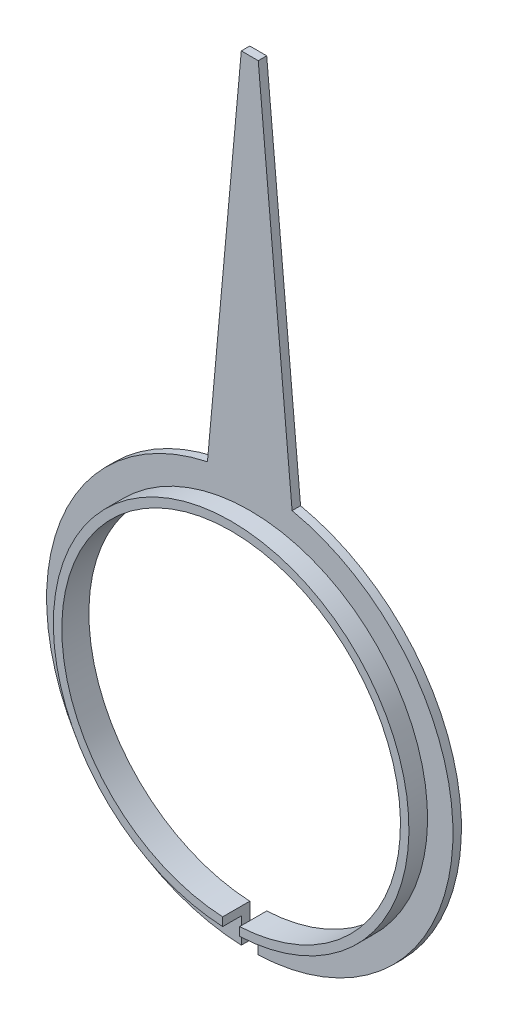
ISO-10303-21;
HEADER;
FILE_DESCRIPTION(('STEP AP214'),'2;1');
FILE_NAME('part.step','',(''),(''),'','','');
FILE_SCHEMA(('AUTOMOTIVE_DESIGN { 1 0 10303 214 1 1 1 1 }'));
ENDSEC;
DATA;
#1=APPLICATION_CONTEXT('core data for automotive mechanical design processes');
#2=APPLICATION_PROTOCOL_DEFINITION('international standard','automotive_design',2000,#1);
#3=PRODUCT_CONTEXT('',#1,'mechanical');
#4=PRODUCT('Part','Part','',(#3));
#5=PRODUCT_RELATED_PRODUCT_CATEGORY('part','',(#4));
#6=PRODUCT_DEFINITION_FORMATION('','',#4);
#7=PRODUCT_DEFINITION_CONTEXT('part definition',#1,'design');
#8=PRODUCT_DEFINITION('design','',#6,#7);
#9=PRODUCT_DEFINITION_SHAPE('','',#8);
#10=(LENGTH_UNIT() NAMED_UNIT(*) SI_UNIT(.MILLI.,.METRE.));
#11=(NAMED_UNIT(*) PLANE_ANGLE_UNIT() SI_UNIT($,.RADIAN.));
#12=(NAMED_UNIT(*) SI_UNIT($,.STERADIAN.) SOLID_ANGLE_UNIT());
#13=UNCERTAINTY_MEASURE_WITH_UNIT(LENGTH_MEASURE(1.E-05),#10,'distance_accuracy_value','');
#14=(GEOMETRIC_REPRESENTATION_CONTEXT(3) GLOBAL_UNCERTAINTY_ASSIGNED_CONTEXT((#13)) GLOBAL_UNIT_ASSIGNED_CONTEXT((#10,
#11,#12)) REPRESENTATION_CONTEXT('',''));
#15=CARTESIAN_POINT('',(0.,0.,0.));
#16=DIRECTION('',(0.,0.,1.));
#17=DIRECTION('',(1.,0.,0.));
#18=AXIS2_PLACEMENT_3D('',#15,#16,#17);
#19=CARTESIAN_POINT('',(0.,0.,0.));
#20=DIRECTION('',(0.,0.,1.));
#21=DIRECTION('',(1.,0.,0.));
#22=AXIS2_PLACEMENT_3D('',#19,#20,#21);
#23=PLANE('',#22);
#24=DIRECTION('',(0.,1.,0.));
#25=VECTOR('',#24,1.);
#26=CARTESIAN_POINT('',(0.1,-1.81103581923026,0.));
#27=LINE('',#26,#25);
#28=CARTESIAN_POINT('',(0.1,-2.39791576165636,0.));
#29=VERTEX_POINT('',#28);
#30=CARTESIAN_POINT('',(0.1,-1.99749843554382,0.));
#31=VERTEX_POINT('',#30);
#32=EDGE_CURVE('E106',#29,#31,#27,.T.);
#33=ORIENTED_EDGE('',*,*,#32,.T.);
#34=CARTESIAN_POINT('',(0.,0.,0.));
#35=DIRECTION('',(0.,0.,1.));
#36=DIRECTION('',(1.,0.,0.));
#37=AXIS2_PLACEMENT_3D('',#34,#35,#36);
#38=CIRCLE('',#37,2.);
#39=CARTESIAN_POINT('',(-0.099999999999986,-1.99749843554382,0.));
#40=VERTEX_POINT('',#39);
#41=EDGE_CURVE('E123',#31,#40,#38,.T.);
#42=ORIENTED_EDGE('',*,*,#41,.T.);
#43=DIRECTION('',(0.,-1.,0.));
#44=VECTOR('',#43,1.);
#45=CARTESIAN_POINT('',(-0.0999999999999873,-1.81103581923026,0.));
#46=LINE('',#45,#44);
#47=CARTESIAN_POINT('',(-0.0999999999999833,-2.39791576165636,0.));
#48=VERTEX_POINT('',#47);
#49=EDGE_CURVE('E47',#40,#48,#46,.T.);
#50=ORIENTED_EDGE('',*,*,#49,.T.);
#51=CARTESIAN_POINT('',(0.,0.,0.));
#52=DIRECTION('',(0.,0.,1.));
#53=DIRECTION('',(1.,0.,0.));
#54=AXIS2_PLACEMENT_3D('',#51,#52,#53);
#55=CIRCLE('',#54,2.4);
#56=CARTESIAN_POINT('',(-0.500000000000016,2.3473389188611,0.));
#57=VERTEX_POINT('',#56);
#58=EDGE_CURVE('E129',#57,#48,#55,.T.);
#59=ORIENTED_EDGE('',*,*,#58,.F.);
#60=DIRECTION('',(-0.0904814720566437,-0.995898138975298,0.));
#61=VECTOR('',#60,1.);
#62=CARTESIAN_POINT('',(-0.100000000001707,6.75000000000546,0.));
#63=LINE('',#62,#61);
#64=CARTESIAN_POINT('',(-0.100000000001707,6.75000000000546,0.));
#65=VERTEX_POINT('',#64);
#66=EDGE_CURVE('E130',#65,#57,#63,.T.);
#67=ORIENTED_EDGE('',*,*,#66,.F.);
#68=DIRECTION('',(-1.,2.72872002766558E-11,0.));
#69=VECTOR('',#68,1.);
#70=CARTESIAN_POINT('',(0.,6.75000000000819,0.));
#71=LINE('',#70,#69);
#72=CARTESIAN_POINT('',(0.10000000000166,6.75000000000546,0.));
#73=VERTEX_POINT('',#72);
#74=EDGE_CURVE('E138',#73,#65,#71,.T.);
#75=ORIENTED_EDGE('',*,*,#74,.F.);
#76=DIRECTION('',(-0.0904814720566506,0.995898138975298,0.));
#77=VECTOR('',#76,1.);
#78=CARTESIAN_POINT('',(0.10000000000166,6.75000000000546,0.));
#79=LINE('',#78,#77);
#80=CARTESIAN_POINT('',(0.5,2.3473389188611,0.));
#81=VERTEX_POINT('',#80);
#82=EDGE_CURVE('E128',#81,#73,#79,.T.);
#83=ORIENTED_EDGE('',*,*,#82,.F.);
#84=EDGE_CURVE('E120',#29,#81,#55,.T.);
#85=ORIENTED_EDGE('',*,*,#84,.F.);
#86=EDGE_LOOP('',(#33,#42,#50,#59,#67,#75,#83,#85));
#87=FACE_BOUND('',#86,.T.);
#88=ADVANCED_FACE('F32',(#87),#23,.F.);
#89=CARTESIAN_POINT('',(0.,0.,0.32));
#90=DIRECTION('',(0.,0.,1.));
#91=DIRECTION('',(1.,0.,0.));
#92=AXIS2_PLACEMENT_3D('',#89,#90,#91);
#93=PLANE('',#92);
#94=CARTESIAN_POINT('',(0.,0.,0.32));
#95=DIRECTION('',(0.,0.,1.));
#96=DIRECTION('',(1.,0.,0.));
#97=AXIS2_PLACEMENT_3D('',#94,#95,#96);
#98=CIRCLE('',#97,2.);
#99=CARTESIAN_POINT('',(0.1,-1.99749843554382,0.32));
#100=VERTEX_POINT('',#99);
#101=CARTESIAN_POINT('',(-0.099999999999986,-1.99749843554382,0.32));
#102=VERTEX_POINT('',#101);
#103=EDGE_CURVE('E156',#100,#102,#98,.T.);
#104=ORIENTED_EDGE('',*,*,#103,.F.);
#105=DIRECTION('',(0.,1.,0.));
#106=VECTOR('',#105,1.);
#107=CARTESIAN_POINT('',(0.1,-1.81103581923026,0.32));
#108=LINE('',#107,#106);
#109=CARTESIAN_POINT('',(0.1,-2.0976176963403,0.32));
#110=VERTEX_POINT('',#109);
#111=EDGE_CURVE('E55',#110,#100,#108,.T.);
#112=ORIENTED_EDGE('',*,*,#111,.F.);
#113=CARTESIAN_POINT('',(0.,0.,0.32));
#114=DIRECTION('',(0.,0.,1.));
#115=DIRECTION('',(1.,0.,0.));
#116=AXIS2_PLACEMENT_3D('',#113,#114,#115);
#117=CIRCLE('',#116,2.1);
#118=CARTESIAN_POINT('',(-0.0999999999999854,-2.0976176963403,0.32));
#119=VERTEX_POINT('',#118);
#120=EDGE_CURVE('E160',#110,#119,#117,.T.);
#121=ORIENTED_EDGE('',*,*,#120,.T.);
#122=DIRECTION('',(0.,-1.,0.));
#123=VECTOR('',#122,1.);
#124=CARTESIAN_POINT('',(-0.0999999999999873,-1.81103581923026,0.32));
#125=LINE('',#124,#123);
#126=EDGE_CURVE('E208',#102,#119,#125,.T.);
#127=ORIENTED_EDGE('',*,*,#126,.F.);
#128=EDGE_LOOP('',(#104,#112,#121,#127));
#129=FACE_BOUND('',#128,.T.);
#130=ADVANCED_FACE('F207',(#129),#93,.T.);
#131=CARTESIAN_POINT('',(0.,0.,0.1));
#132=DIRECTION('',(0.,0.,1.));
#133=DIRECTION('',(1.,0.,0.));
#134=AXIS2_PLACEMENT_3D('',#131,#132,#133);
#135=PLANE('',#134);
#136=CARTESIAN_POINT('',(0.,0.,0.1));
#137=DIRECTION('',(0.,0.,1.));
#138=DIRECTION('',(1.,0.,0.));
#139=AXIS2_PLACEMENT_3D('',#136,#137,#138);
#140=CIRCLE('',#139,2.1);
#141=CARTESIAN_POINT('',(-0.0999999999999853,-2.0976176963403,0.1));
#142=VERTEX_POINT('',#141);
#143=CARTESIAN_POINT('',(0.1,-2.0976176963403,0.1));
#144=VERTEX_POINT('',#143);
#145=EDGE_CURVE('E133',#142,#144,#140,.F.);
#146=ORIENTED_EDGE('',*,*,#145,.T.);
#147=DIRECTION('',(0.,-1.,0.));
#148=VECTOR('',#147,1.);
#149=CARTESIAN_POINT('',(0.1,0.,0.1));
#150=LINE('',#149,#148);
#151=CARTESIAN_POINT('',(0.1,-2.39791576165636,0.1));
#152=VERTEX_POINT('',#151);
#153=EDGE_CURVE('E124',#144,#152,#150,.T.);
#154=ORIENTED_EDGE('',*,*,#153,.T.);
#155=CARTESIAN_POINT('',(0.,0.,0.1));
#156=DIRECTION('',(0.,0.,1.));
#157=DIRECTION('',(1.,0.,0.));
#158=AXIS2_PLACEMENT_3D('',#155,#156,#157);
#159=CIRCLE('',#158,2.4);
#160=CARTESIAN_POINT('',(0.5,2.3473389188611,0.1));
#161=VERTEX_POINT('',#160);
#162=EDGE_CURVE('E122',#152,#161,#159,.T.);
#163=ORIENTED_EDGE('',*,*,#162,.T.);
#164=DIRECTION('',(-0.0904814720566506,0.995898138975298,0.));
#165=VECTOR('',#164,1.);
#166=CARTESIAN_POINT('',(0.10000000000166,6.75000000000546,0.1));
#167=LINE('',#166,#165);
#168=CARTESIAN_POINT('',(0.10000000000166,6.75000000000546,0.1));
#169=VERTEX_POINT('',#168);
#170=EDGE_CURVE('E145',#161,#169,#167,.T.);
#171=ORIENTED_EDGE('',*,*,#170,.T.);
#172=DIRECTION('',(-1.,-2.72872002766558E-11,0.));
#173=VECTOR('',#172,1.);
#174=CARTESIAN_POINT('',(0.,6.75000000000819,0.1));
#175=LINE('',#174,#173);
#176=CARTESIAN_POINT('',(-0.100000000001707,6.75000000000546,0.1));
#177=VERTEX_POINT('',#176);
#178=EDGE_CURVE('E140',#169,#177,#175,.T.);
#179=ORIENTED_EDGE('',*,*,#178,.T.);
#180=DIRECTION('',(-0.0904814720566437,-0.995898138975298,0.));
#181=VECTOR('',#180,1.);
#182=CARTESIAN_POINT('',(-0.100000000001707,6.75000000000546,0.1));
#183=LINE('',#182,#181);
#184=CARTESIAN_POINT('',(-0.500000000000016,2.3473389188611,0.1));
#185=VERTEX_POINT('',#184);
#186=EDGE_CURVE('E169',#177,#185,#183,.T.);
#187=ORIENTED_EDGE('',*,*,#186,.T.);
#188=CARTESIAN_POINT('',(-0.0999999999999833,-2.39791576165636,0.1));
#189=VERTEX_POINT('',#188);
#190=EDGE_CURVE('E171',#185,#189,#159,.T.);
#191=ORIENTED_EDGE('',*,*,#190,.T.);
#192=DIRECTION('',(0.,1.,0.));
#193=VECTOR('',#192,1.);
#194=CARTESIAN_POINT('',(-0.1,0.,0.1));
#195=LINE('',#194,#193);
#196=EDGE_CURVE('E188',#189,#142,#195,.T.);
#197=ORIENTED_EDGE('',*,*,#196,.T.);
#198=EDGE_LOOP('',(#146,#154,#163,#171,#179,#187,#191,#197));
#199=FACE_BOUND('',#198,.T.);
#200=ADVANCED_FACE('F177',(#199),#135,.T.);
#201=CARTESIAN_POINT('',(0.,0.,0.1));
#202=DIRECTION('',(0.,0.,-1.));
#203=DIRECTION('',(-1.,0.,0.));
#204=AXIS2_PLACEMENT_3D('',#201,#202,#203);
#205=CYLINDRICAL_SURFACE('',#204,2.4);
#206=DIRECTION('',(0.,0.,-1.));
#207=VECTOR('',#206,1.);
#208=CARTESIAN_POINT('',(0.1,-2.39791576165636,0.1));
#209=LINE('',#208,#207);
#210=EDGE_CURVE('E109',#29,#152,#209,.F.);
#211=ORIENTED_EDGE('',*,*,#210,.F.);
#212=ORIENTED_EDGE('',*,*,#84,.T.);
#213=DIRECTION('',(0.,0.,-1.));
#214=VECTOR('',#213,1.);
#215=CARTESIAN_POINT('',(0.5,2.3473389188611,0.1));
#216=LINE('',#215,#214);
#217=EDGE_CURVE('E144',#161,#81,#216,.T.);
#218=ORIENTED_EDGE('',*,*,#217,.F.);
#219=ORIENTED_EDGE('',*,*,#162,.F.);
#220=EDGE_LOOP('',(#211,#212,#218,#219));
#221=FACE_BOUND('',#220,.T.);
#222=ADVANCED_FACE('F118',(#221),#205,.T.);
#223=DIRECTION('',(0.,0.,-1.));
#224=VECTOR('',#223,1.);
#225=CARTESIAN_POINT('',(-0.0999999999999832,-2.39791576165636,0.1));
#226=LINE('',#225,#224);
#227=EDGE_CURVE('E193',#189,#48,#226,.T.);
#228=ORIENTED_EDGE('',*,*,#227,.F.);
#229=ORIENTED_EDGE('',*,*,#190,.F.);
#230=DIRECTION('',(0.,0.,-1.));
#231=VECTOR('',#230,1.);
#232=CARTESIAN_POINT('',(-0.500000000000016,2.3473389188611,0.1));
#233=LINE('',#232,#231);
#234=EDGE_CURVE('E147',#185,#57,#233,.T.);
#235=ORIENTED_EDGE('',*,*,#234,.T.);
#236=ORIENTED_EDGE('',*,*,#58,.T.);
#237=EDGE_LOOP('',(#228,#229,#235,#236));
#238=FACE_BOUND('',#237,.T.);
#239=ADVANCED_FACE('F192',(#238),#205,.T.);
#240=CARTESIAN_POINT('',(0.,0.,0.32));
#241=DIRECTION('',(0.,0.,-1.));
#242=DIRECTION('',(-1.,0.,0.));
#243=AXIS2_PLACEMENT_3D('',#240,#241,#242);
#244=CYLINDRICAL_SURFACE('',#243,2.1);
#245=DIRECTION('',(0.,0.,-1.));
#246=VECTOR('',#245,1.);
#247=CARTESIAN_POINT('',(0.1,-2.0976176963403,0.32));
#248=LINE('',#247,#246);
#249=EDGE_CURVE('E194',#144,#110,#248,.F.);
#250=ORIENTED_EDGE('',*,*,#249,.F.);
#251=ORIENTED_EDGE('',*,*,#145,.F.);
#252=DIRECTION('',(0.,0.,-1.));
#253=VECTOR('',#252,1.);
#254=CARTESIAN_POINT('',(-0.0999999999999853,-2.0976176963403,0.32));
#255=LINE('',#254,#253);
#256=EDGE_CURVE('E197',#119,#142,#255,.T.);
#257=ORIENTED_EDGE('',*,*,#256,.F.);
#258=ORIENTED_EDGE('',*,*,#120,.F.);
#259=EDGE_LOOP('',(#250,#251,#257,#258));
#260=FACE_BOUND('',#259,.T.);
#261=ADVANCED_FACE('F204',(#260),#244,.T.);
#262=CARTESIAN_POINT('',(0.,0.,0.32));
#263=DIRECTION('',(0.,0.,-1.));
#264=DIRECTION('',(-1.,0.,0.));
#265=AXIS2_PLACEMENT_3D('',#262,#263,#264);
#266=CYLINDRICAL_SURFACE('',#265,2.);
#267=ORIENTED_EDGE('',*,*,#41,.F.);
#268=DIRECTION('',(0.,0.,-1.));
#269=VECTOR('',#268,1.);
#270=CARTESIAN_POINT('',(0.1,-1.99749843554382,0.32));
#271=LINE('',#270,#269);
#272=EDGE_CURVE('E11',#31,#100,#271,.F.);
#273=ORIENTED_EDGE('',*,*,#272,.T.);
#274=ORIENTED_EDGE('',*,*,#103,.T.);
#275=DIRECTION('',(0.,0.,-1.));
#276=VECTOR('',#275,1.);
#277=CARTESIAN_POINT('',(-0.099999999999986,-1.99749843554382,0.32));
#278=LINE('',#277,#276);
#279=EDGE_CURVE('E40',#102,#40,#278,.T.);
#280=ORIENTED_EDGE('',*,*,#279,.T.);
#281=EDGE_LOOP('',(#267,#273,#274,#280));
#282=FACE_BOUND('',#281,.T.);
#283=ADVANCED_FACE('F154',(#282),#266,.F.);
#284=CARTESIAN_POINT('',(-0.100000000001707,6.75000000000546,0.1));
#285=DIRECTION('',(0.995898138975298,-0.0904814720566437,0.));
#286=DIRECTION('',(0.0904814720566437,0.995898138975298,0.));
#287=AXIS2_PLACEMENT_3D('',#284,#285,#286);
#288=PLANE('',#287);
#289=ORIENTED_EDGE('',*,*,#66,.T.);
#290=ORIENTED_EDGE('',*,*,#234,.F.);
#291=ORIENTED_EDGE('',*,*,#186,.F.);
#292=DIRECTION('',(0.,0.,-1.));
#293=VECTOR('',#292,1.);
#294=CARTESIAN_POINT('',(-0.100000000001707,6.75000000000546,0.1));
#295=LINE('',#294,#293);
#296=EDGE_CURVE('E150',#177,#65,#295,.T.);
#297=ORIENTED_EDGE('',*,*,#296,.T.);
#298=EDGE_LOOP('',(#289,#290,#291,#297));
#299=FACE_BOUND('',#298,.T.);
#300=ADVANCED_FACE('F34',(#299),#288,.F.);
#301=CARTESIAN_POINT('',(0.10000000000166,6.75000000000546,0.1));
#302=DIRECTION('',(-0.995898138975298,-0.0904814720566506,0.));
#303=DIRECTION('',(0.0904814720566506,-0.995898138975298,0.));
#304=AXIS2_PLACEMENT_3D('',#301,#302,#303);
#305=PLANE('',#304);
#306=ORIENTED_EDGE('',*,*,#82,.T.);
#307=DIRECTION('',(0.,0.,-1.));
#308=VECTOR('',#307,1.);
#309=CARTESIAN_POINT('',(0.10000000000166,6.75000000000546,0.1));
#310=LINE('',#309,#308);
#311=EDGE_CURVE('E141',#169,#73,#310,.T.);
#312=ORIENTED_EDGE('',*,*,#311,.F.);
#313=ORIENTED_EDGE('',*,*,#170,.F.);
#314=ORIENTED_EDGE('',*,*,#217,.T.);
#315=EDGE_LOOP('',(#306,#312,#313,#314));
#316=FACE_BOUND('',#315,.T.);
#317=ADVANCED_FACE('F180',(#316),#305,.F.);
#318=CARTESIAN_POINT('',(0.,6.75000000000819,0.1));
#319=DIRECTION('',(-2.72872002766558E-11,-1.,0.));
#320=DIRECTION('',(1.,-2.72872002766558E-11,0.));
#321=AXIS2_PLACEMENT_3D('',#318,#319,#320);
#322=PLANE('',#321);
#323=ORIENTED_EDGE('',*,*,#74,.T.);
#324=ORIENTED_EDGE('',*,*,#296,.F.);
#325=ORIENTED_EDGE('',*,*,#178,.F.);
#326=ORIENTED_EDGE('',*,*,#311,.T.);
#327=EDGE_LOOP('',(#323,#324,#325,#326));
#328=FACE_BOUND('',#327,.T.);
#329=ADVANCED_FACE('F182',(#328),#322,.F.);
#330=CARTESIAN_POINT('',(-0.0999999999999873,-1.81103581923026,0.32));
#331=DIRECTION('',(1.,0.,0.));
#332=DIRECTION('',(0.,1.,0.));
#333=AXIS2_PLACEMENT_3D('',#330,#331,#332);
#334=PLANE('',#333);
#335=ORIENTED_EDGE('',*,*,#227,.T.);
#336=ORIENTED_EDGE('',*,*,#49,.F.);
#337=ORIENTED_EDGE('',*,*,#279,.F.);
#338=ORIENTED_EDGE('',*,*,#126,.T.);
#339=ORIENTED_EDGE('',*,*,#256,.T.);
#340=ORIENTED_EDGE('',*,*,#196,.F.);
#341=EDGE_LOOP('',(#335,#336,#337,#338,#339,#340));
#342=FACE_BOUND('',#341,.T.);
#343=ADVANCED_FACE('F212',(#342),#334,.T.);
#344=CARTESIAN_POINT('',(0.1,-1.81103581923026,0.32));
#345=DIRECTION('',(-1.,0.,0.));
#346=DIRECTION('',(0.,0.,1.));
#347=AXIS2_PLACEMENT_3D('',#344,#345,#346);
#348=PLANE('',#347);
#349=ORIENTED_EDGE('',*,*,#210,.T.);
#350=ORIENTED_EDGE('',*,*,#153,.F.);
#351=ORIENTED_EDGE('',*,*,#249,.T.);
#352=ORIENTED_EDGE('',*,*,#111,.T.);
#353=ORIENTED_EDGE('',*,*,#272,.F.);
#354=ORIENTED_EDGE('',*,*,#32,.F.);
#355=EDGE_LOOP('',(#349,#350,#351,#352,#353,#354));
#356=FACE_BOUND('',#355,.T.);
#357=ADVANCED_FACE('F108',(#356),#348,.T.);
#358=CLOSED_SHELL('',(#88,#130,#200,#222,#239,#261,#283,#300,#317,#329,#343,#357));
#359=MANIFOLD_SOLID_BREP('B2',#358);
#360=ADVANCED_BREP_SHAPE_REPRESENTATION('',(#18,#359),#14);
#361=SHAPE_DEFINITION_REPRESENTATION(#9,#360);
ENDSEC;
END-ISO-10303-21;
